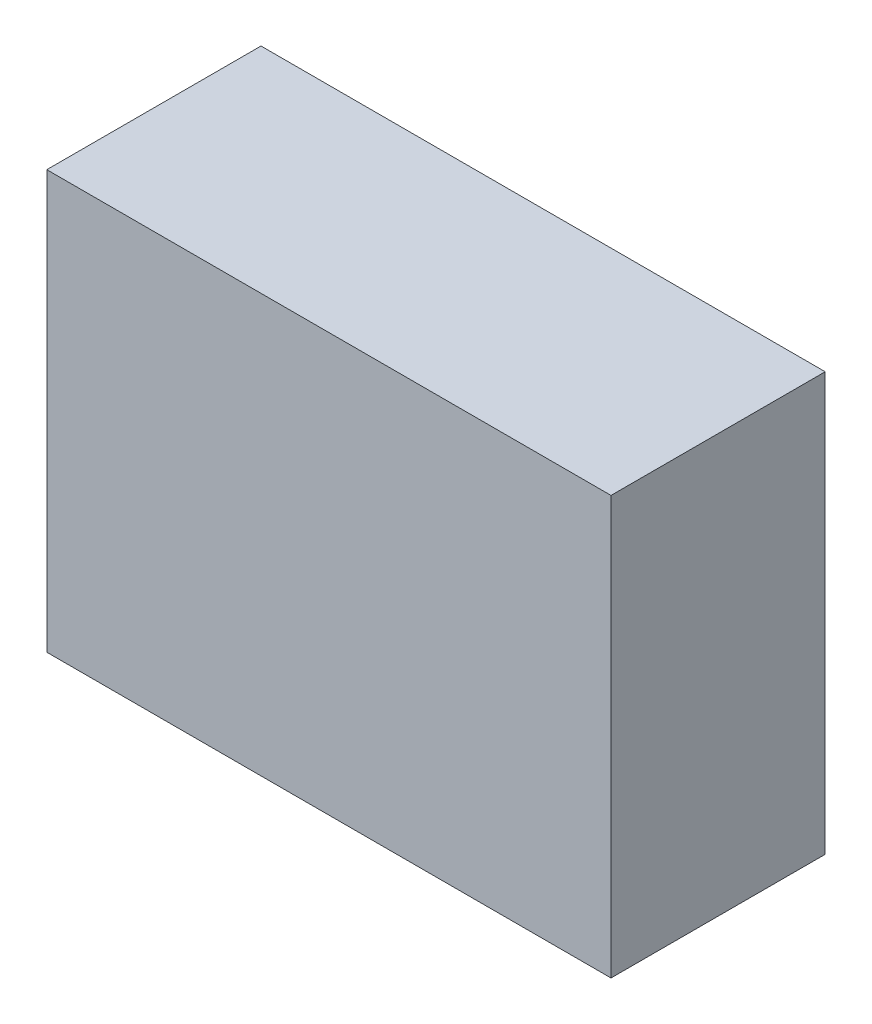
ISO-10303-21;
HEADER;
FILE_DESCRIPTION(('STEP AP214'),'2;1');
FILE_NAME('part.step','',(''),(''),'','','');
FILE_SCHEMA(('AUTOMOTIVE_DESIGN { 1 0 10303 214 1 1 1 1 }'));
ENDSEC;
DATA;
#1=APPLICATION_CONTEXT('core data for automotive mechanical design processes');
#2=APPLICATION_PROTOCOL_DEFINITION('international standard','automotive_design',2000,#1);
#3=PRODUCT_CONTEXT('',#1,'mechanical');
#4=PRODUCT('Part','Part','',(#3));
#5=PRODUCT_RELATED_PRODUCT_CATEGORY('part','',(#4));
#6=PRODUCT_DEFINITION_FORMATION('','',#4);
#7=PRODUCT_DEFINITION_CONTEXT('part definition',#1,'design');
#8=PRODUCT_DEFINITION('design','',#6,#7);
#9=PRODUCT_DEFINITION_SHAPE('','',#8);
#10=(LENGTH_UNIT() NAMED_UNIT(*) SI_UNIT(.MILLI.,.METRE.));
#11=(NAMED_UNIT(*) PLANE_ANGLE_UNIT() SI_UNIT($,.RADIAN.));
#12=(NAMED_UNIT(*) SI_UNIT($,.STERADIAN.) SOLID_ANGLE_UNIT());
#13=UNCERTAINTY_MEASURE_WITH_UNIT(LENGTH_MEASURE(1.E-05),#10,'distance_accuracy_value','');
#14=(GEOMETRIC_REPRESENTATION_CONTEXT(3) GLOBAL_UNCERTAINTY_ASSIGNED_CONTEXT((#13)) GLOBAL_UNIT_ASSIGNED_CONTEXT((#10,
#11,#12)) REPRESENTATION_CONTEXT('',''));
#15=CARTESIAN_POINT('',(0.,0.,0.));
#16=DIRECTION('',(0.,0.,1.));
#17=DIRECTION('',(1.,0.,0.));
#18=AXIS2_PLACEMENT_3D('',#15,#16,#17);
#19=CARTESIAN_POINT('',(0.,0.,2.05000098));
#20=DIRECTION('',(0.,0.,1.));
#21=DIRECTION('',(1.,0.,0.));
#22=AXIS2_PLACEMENT_3D('',#19,#20,#21);
#23=PLANE('',#22);
#24=DIRECTION('',(0.,1.,0.));
#25=VECTOR('',#24,1.);
#26=CARTESIAN_POINT('',(2.69999968,-2.00000108,2.05000098));
#27=LINE('',#26,#25);
#28=CARTESIAN_POINT('',(2.69999968,-2.00000108,2.05000098));
#29=VERTEX_POINT('',#28);
#30=CARTESIAN_POINT('',(2.69999968,2.00000108,2.05000098));
#31=VERTEX_POINT('',#30);
#32=EDGE_CURVE('E86',#29,#31,#27,.T.);
#33=ORIENTED_EDGE('',*,*,#32,.T.);
#34=DIRECTION('',(-1.,0.,0.));
#35=VECTOR('',#34,1.);
#36=CARTESIAN_POINT('',(2.69999968,2.00000108,2.05000098));
#37=LINE('',#36,#35);
#38=CARTESIAN_POINT('',(-2.69999968,2.00000108,2.05000098));
#39=VERTEX_POINT('',#38);
#40=EDGE_CURVE('E74',#31,#39,#37,.T.);
#41=ORIENTED_EDGE('',*,*,#40,.T.);
#42=DIRECTION('',(0.,-1.,0.));
#43=VECTOR('',#42,1.);
#44=CARTESIAN_POINT('',(-2.69999968,2.00000108,2.05000098));
#45=LINE('',#44,#43);
#46=CARTESIAN_POINT('',(-2.69999968,-2.00000108,2.05000098));
#47=VERTEX_POINT('',#46);
#48=EDGE_CURVE('E104',#39,#47,#45,.T.);
#49=ORIENTED_EDGE('',*,*,#48,.T.);
#50=DIRECTION('',(1.,0.,0.));
#51=VECTOR('',#50,1.);
#52=CARTESIAN_POINT('',(-2.69999968,-2.00000108,2.05000098));
#53=LINE('',#52,#51);
#54=EDGE_CURVE('E11',#47,#29,#53,.T.);
#55=ORIENTED_EDGE('',*,*,#54,.T.);
#56=EDGE_LOOP('',(#33,#41,#49,#55));
#57=FACE_BOUND('',#56,.T.);
#58=ADVANCED_FACE('F16',(#57),#23,.T.);
#59=CARTESIAN_POINT('',(0.,0.,0.));
#60=DIRECTION('',(0.,0.,1.));
#61=DIRECTION('',(1.,0.,0.));
#62=AXIS2_PLACEMENT_3D('',#59,#60,#61);
#63=PLANE('',#62);
#64=DIRECTION('',(0.,1.,0.));
#65=VECTOR('',#64,1.);
#66=CARTESIAN_POINT('',(2.69999968,-2.00000108,0.));
#67=LINE('',#66,#65);
#68=CARTESIAN_POINT('',(2.69999968,-2.00000108,0.));
#69=VERTEX_POINT('',#68);
#70=CARTESIAN_POINT('',(2.69999968,2.00000108,0.));
#71=VERTEX_POINT('',#70);
#72=EDGE_CURVE('E92',#69,#71,#67,.T.);
#73=ORIENTED_EDGE('',*,*,#72,.F.);
#74=DIRECTION('',(1.,0.,0.));
#75=VECTOR('',#74,1.);
#76=CARTESIAN_POINT('',(-2.69999968,-2.00000108,0.));
#77=LINE('',#76,#75);
#78=CARTESIAN_POINT('',(-2.69999968,-2.00000108,0.));
#79=VERTEX_POINT('',#78);
#80=EDGE_CURVE('E27',#79,#69,#77,.T.);
#81=ORIENTED_EDGE('',*,*,#80,.F.);
#82=DIRECTION('',(0.,-1.,0.));
#83=VECTOR('',#82,1.);
#84=CARTESIAN_POINT('',(-2.69999968,2.00000108,0.));
#85=LINE('',#84,#83);
#86=CARTESIAN_POINT('',(-2.69999968,2.00000108,0.));
#87=VERTEX_POINT('',#86);
#88=EDGE_CURVE('E83',#87,#79,#85,.T.);
#89=ORIENTED_EDGE('',*,*,#88,.F.);
#90=DIRECTION('',(-1.,0.,0.));
#91=VECTOR('',#90,1.);
#92=CARTESIAN_POINT('',(2.69999968,2.00000108,0.));
#93=LINE('',#92,#91);
#94=EDGE_CURVE('E66',#71,#87,#93,.T.);
#95=ORIENTED_EDGE('',*,*,#94,.F.);
#96=EDGE_LOOP('',(#73,#81,#89,#95));
#97=FACE_BOUND('',#96,.T.);
#98=ADVANCED_FACE('F122',(#97),#63,.F.);
#99=CARTESIAN_POINT('',(-2.69999968,-2.00000108,0.));
#100=DIRECTION('',(0.,1.,0.));
#101=DIRECTION('',(1.,0.,0.));
#102=AXIS2_PLACEMENT_3D('',#99,#100,#101);
#103=PLANE('',#102);
#104=DIRECTION('',(0.,0.,1.));
#105=VECTOR('',#104,1.);
#106=CARTESIAN_POINT('',(-2.69999968,-2.00000108,0.));
#107=LINE('',#106,#105);
#108=EDGE_CURVE('E20',#79,#47,#107,.T.);
#109=ORIENTED_EDGE('',*,*,#108,.F.);
#110=ORIENTED_EDGE('',*,*,#80,.T.);
#111=DIRECTION('',(0.,0.,1.));
#112=VECTOR('',#111,1.);
#113=CARTESIAN_POINT('',(2.69999968,-2.00000108,0.));
#114=LINE('',#113,#112);
#115=EDGE_CURVE('E99',#69,#29,#114,.T.);
#116=ORIENTED_EDGE('',*,*,#115,.T.);
#117=ORIENTED_EDGE('',*,*,#54,.F.);
#118=EDGE_LOOP('',(#109,#110,#116,#117));
#119=FACE_BOUND('',#118,.T.);
#120=ADVANCED_FACE('F120',(#119),#103,.F.);
#121=CARTESIAN_POINT('',(-2.69999968,2.00000108,0.));
#122=DIRECTION('',(1.,0.,0.));
#123=DIRECTION('',(0.,1.,0.));
#124=AXIS2_PLACEMENT_3D('',#121,#122,#123);
#125=PLANE('',#124);
#126=DIRECTION('',(0.,0.,1.));
#127=VECTOR('',#126,1.);
#128=CARTESIAN_POINT('',(-2.69999968,2.00000108,0.));
#129=LINE('',#128,#127);
#130=EDGE_CURVE('E80',#87,#39,#129,.T.);
#131=ORIENTED_EDGE('',*,*,#130,.F.);
#132=ORIENTED_EDGE('',*,*,#88,.T.);
#133=ORIENTED_EDGE('',*,*,#108,.T.);
#134=ORIENTED_EDGE('',*,*,#48,.F.);
#135=EDGE_LOOP('',(#131,#132,#133,#134));
#136=FACE_BOUND('',#135,.T.);
#137=ADVANCED_FACE('F130',(#136),#125,.F.);
#138=CARTESIAN_POINT('',(2.69999968,2.00000108,0.));
#139=DIRECTION('',(0.,-1.,0.));
#140=DIRECTION('',(0.,0.,-1.));
#141=AXIS2_PLACEMENT_3D('',#138,#139,#140);
#142=PLANE('',#141);
#143=DIRECTION('',(0.,0.,1.));
#144=VECTOR('',#143,1.);
#145=CARTESIAN_POINT('',(2.69999968,2.00000108,0.));
#146=LINE('',#145,#144);
#147=EDGE_CURVE('E77',#71,#31,#146,.T.);
#148=ORIENTED_EDGE('',*,*,#147,.F.);
#149=ORIENTED_EDGE('',*,*,#94,.T.);
#150=ORIENTED_EDGE('',*,*,#130,.T.);
#151=ORIENTED_EDGE('',*,*,#40,.F.);
#152=EDGE_LOOP('',(#148,#149,#150,#151));
#153=FACE_BOUND('',#152,.T.);
#154=ADVANCED_FACE('F18',(#153),#142,.F.);
#155=CARTESIAN_POINT('',(2.69999968,-2.00000108,0.));
#156=DIRECTION('',(-1.,0.,0.));
#157=DIRECTION('',(0.,0.,1.));
#158=AXIS2_PLACEMENT_3D('',#155,#156,#157);
#159=PLANE('',#158);
#160=ORIENTED_EDGE('',*,*,#115,.F.);
#161=ORIENTED_EDGE('',*,*,#72,.T.);
#162=ORIENTED_EDGE('',*,*,#147,.T.);
#163=ORIENTED_EDGE('',*,*,#32,.F.);
#164=EDGE_LOOP('',(#160,#161,#162,#163));
#165=FACE_BOUND('',#164,.T.);
#166=ADVANCED_FACE('F91',(#165),#159,.F.);
#167=CLOSED_SHELL('',(#58,#98,#120,#137,#154,#166));
#168=MANIFOLD_SOLID_BREP('B1',#167);
#169=ADVANCED_BREP_SHAPE_REPRESENTATION('',(#18,#168),#14);
#170=SHAPE_DEFINITION_REPRESENTATION(#9,#169);
ENDSEC;
END-ISO-10303-21;
